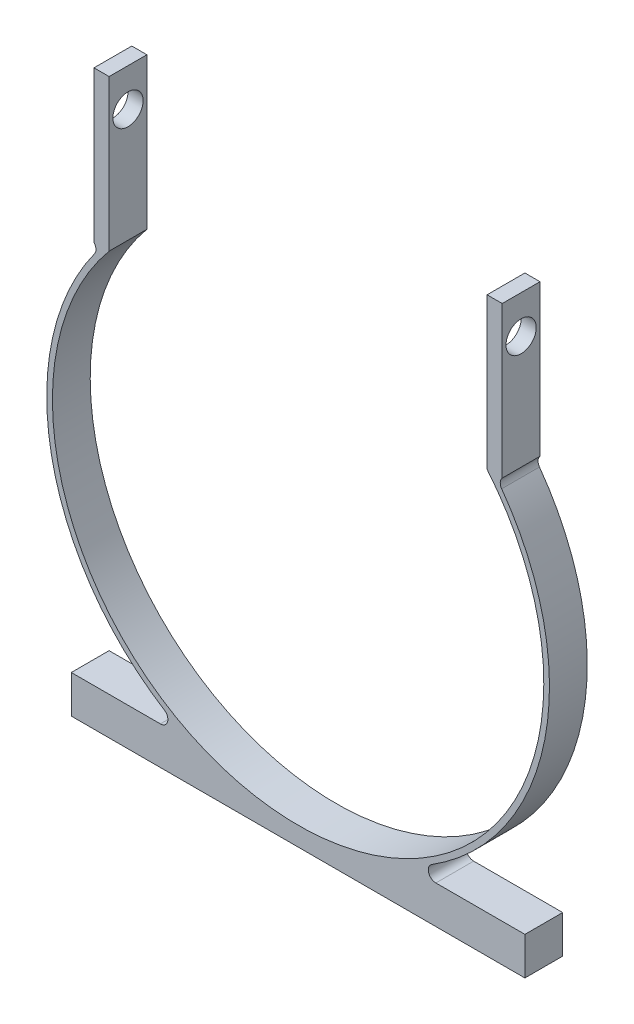
ISO-10303-21;
HEADER;
FILE_DESCRIPTION(('STEP AP214'),'2;1');
FILE_NAME('part.step','',(''),(''),'','','');
FILE_SCHEMA(('AUTOMOTIVE_DESIGN { 1 0 10303 214 1 1 1 1 }'));
ENDSEC;
DATA;
#1=APPLICATION_CONTEXT('core data for automotive mechanical design processes');
#2=APPLICATION_PROTOCOL_DEFINITION('international standard','automotive_design',2000,#1);
#3=PRODUCT_CONTEXT('',#1,'mechanical');
#4=PRODUCT('Part','Part','',(#3));
#5=PRODUCT_RELATED_PRODUCT_CATEGORY('part','',(#4));
#6=PRODUCT_DEFINITION_FORMATION('','',#4);
#7=PRODUCT_DEFINITION_CONTEXT('part definition',#1,'design');
#8=PRODUCT_DEFINITION('design','',#6,#7);
#9=PRODUCT_DEFINITION_SHAPE('','',#8);
#10=(LENGTH_UNIT() NAMED_UNIT(*) SI_UNIT(.MILLI.,.METRE.));
#11=(NAMED_UNIT(*) PLANE_ANGLE_UNIT() SI_UNIT($,.RADIAN.));
#12=(NAMED_UNIT(*) SI_UNIT($,.STERADIAN.) SOLID_ANGLE_UNIT());
#13=UNCERTAINTY_MEASURE_WITH_UNIT(LENGTH_MEASURE(1.E-05),#10,'distance_accuracy_value','');
#14=(GEOMETRIC_REPRESENTATION_CONTEXT(3) GLOBAL_UNCERTAINTY_ASSIGNED_CONTEXT((#13)) GLOBAL_UNIT_ASSIGNED_CONTEXT((#10,
#11,#12)) REPRESENTATION_CONTEXT('',''));
#15=CARTESIAN_POINT('',(0.,0.,0.));
#16=DIRECTION('',(0.,0.,1.));
#17=DIRECTION('',(1.,0.,0.));
#18=AXIS2_PLACEMENT_3D('',#15,#16,#17);
#19=CARTESIAN_POINT('',(0.,0.,6.35));
#20=DIRECTION('',(0.,0.,-1.));
#21=DIRECTION('',(-1.,0.,0.));
#22=AXIS2_PLACEMENT_3D('',#19,#20,#21);
#23=CYLINDRICAL_SURFACE('',#22,42.2275);
#24=CARTESIAN_POINT('',(0.,0.,0.));
#25=DIRECTION('',(0.,0.,1.));
#26=DIRECTION('',(1.,0.,0.));
#27=AXIS2_PLACEMENT_3D('',#24,#25,#26);
#28=CIRCLE('',#27,42.2275);
#29=CARTESIAN_POINT('',(22.4669806566935,-35.7546715328467,0.));
#30=VERTEX_POINT('',#29);
#31=CARTESIAN_POINT('',(34.198566610267,24.7713503477935,0.));
#32=VERTEX_POINT('',#31);
#33=EDGE_CURVE('E259',#30,#32,#28,.T.);
#34=ORIENTED_EDGE('',*,*,#33,.T.);
#35=DIRECTION('',(0.,0.,-1.));
#36=VECTOR('',#35,1.);
#37=CARTESIAN_POINT('',(34.198566610267,24.7713503477935,6.35));
#38=LINE('',#37,#36);
#39=CARTESIAN_POINT('',(34.198566610267,24.7713503477935,6.35));
#40=VERTEX_POINT('',#39);
#41=EDGE_CURVE('E55',#32,#40,#38,.F.);
#42=ORIENTED_EDGE('',*,*,#41,.T.);
#43=CARTESIAN_POINT('',(0.,0.,6.35));
#44=DIRECTION('',(0.,0.,1.));
#45=DIRECTION('',(1.,0.,0.));
#46=AXIS2_PLACEMENT_3D('',#43,#44,#45);
#47=CIRCLE('',#46,42.2275);
#48=CARTESIAN_POINT('',(22.4669806566935,-35.7546715328467,6.35));
#49=VERTEX_POINT('',#48);
#50=EDGE_CURVE('E244',#49,#40,#47,.T.);
#51=ORIENTED_EDGE('',*,*,#50,.F.);
#52=DIRECTION('',(0.,0.,-1.));
#53=VECTOR('',#52,1.);
#54=CARTESIAN_POINT('',(22.4669806566935,-35.7546715328467,6.35));
#55=LINE('',#54,#53);
#56=EDGE_CURVE('E276',#49,#30,#55,.T.);
#57=ORIENTED_EDGE('',*,*,#56,.T.);
#58=EDGE_LOOP('',(#34,#42,#51,#57));
#59=FACE_BOUND('',#58,.T.);
#60=ADVANCED_FACE('F33',(#59),#23,.T.);
#61=CARTESIAN_POINT('',(0.,0.,6.35));
#62=DIRECTION('',(0.,0.,1.));
#63=DIRECTION('',(1.,0.,0.));
#64=AXIS2_PLACEMENT_3D('',#61,#62,#63);
#65=PLANE('',#64);
#66=DIRECTION('',(0.,-1.,0.));
#67=VECTOR('',#66,1.);
#68=CARTESIAN_POINT('',(31.75,61.2775,6.35));
#69=LINE('',#68,#67);
#70=CARTESIAN_POINT('',(31.75,51.7735307647649,6.35));
#71=VERTEX_POINT('',#70);
#72=CARTESIAN_POINT('',(31.75,26.3735307647649,6.35));
#73=VERTEX_POINT('',#72);
#74=EDGE_CURVE('E192',#71,#73,#69,.T.);
#75=ORIENTED_EDGE('',*,*,#74,.T.);
#76=CARTESIAN_POINT('',(0.,0.,6.35));
#77=DIRECTION('',(0.,0.,1.));
#78=DIRECTION('',(1.,0.,0.));
#79=AXIS2_PLACEMENT_3D('',#76,#77,#78);
#80=CIRCLE('',#79,41.275);
#81=CARTESIAN_POINT('',(-31.75,26.3735307647649,6.35));
#82=VERTEX_POINT('',#81);
#83=EDGE_CURVE('E226',#82,#73,#80,.T.);
#84=ORIENTED_EDGE('',*,*,#83,.F.);
#85=DIRECTION('',(0.,-1.,0.));
#86=VECTOR('',#85,1.);
#87=CARTESIAN_POINT('',(-31.75,61.2775,6.35));
#88=LINE('',#87,#86);
#89=CARTESIAN_POINT('',(-31.75,51.7735307647649,6.35));
#90=VERTEX_POINT('',#89);
#91=EDGE_CURVE('E219',#90,#82,#88,.T.);
#92=ORIENTED_EDGE('',*,*,#91,.F.);
#93=DIRECTION('',(1.,0.,0.));
#94=VECTOR('',#93,1.);
#95=CARTESIAN_POINT('',(-34.29,51.7735307647649,6.35));
#96=LINE('',#95,#94);
#97=CARTESIAN_POINT('',(-34.29,51.7735307647649,6.35));
#98=VERTEX_POINT('',#97);
#99=EDGE_CURVE('E216',#98,#90,#96,.T.);
#100=ORIENTED_EDGE('',*,*,#99,.F.);
#101=DIRECTION('',(0.,-1.,0.));
#102=VECTOR('',#101,1.);
#103=CARTESIAN_POINT('',(-34.29,26.3735307647649,6.35));
#104=LINE('',#103,#102);
#105=CARTESIAN_POINT('',(-34.29,26.3735307647649,6.35));
#106=VERTEX_POINT('',#105);
#107=EDGE_CURVE('E201',#98,#106,#104,.T.);
#108=ORIENTED_EDGE('',*,*,#107,.T.);
#109=CARTESIAN_POINT('',(-35.2270949293728,25.5163533657722,6.35));
#110=DIRECTION('',(0.,0.,1.));
#111=DIRECTION('',(1.,0.,0.));
#112=AXIS2_PLACEMENT_3D('',#109,#110,#111);
#113=CIRCLE('',#112,1.27);
#114=CARTESIAN_POINT('',(-34.198566610267,24.7713503477935,6.35));
#115=VERTEX_POINT('',#114);
#116=EDGE_CURVE('E298',#106,#115,#113,.F.);
#117=ORIENTED_EDGE('',*,*,#116,.T.);
#118=CARTESIAN_POINT('',(-22.4669806566935,-35.7546715328467,6.35));
#119=VERTEX_POINT('',#118);
#120=EDGE_CURVE('E243',#115,#119,#47,.T.);
#121=ORIENTED_EDGE('',*,*,#120,.T.);
#122=CARTESIAN_POINT('',(-23.1426793230602,-36.83,6.35));
#123=DIRECTION('',(0.,0.,1.));
#124=DIRECTION('',(1.,0.,0.));
#125=AXIS2_PLACEMENT_3D('',#122,#123,#124);
#126=CIRCLE('',#125,1.27);
#127=CARTESIAN_POINT('',(-23.1426793230602,-38.1,6.35));
#128=VERTEX_POINT('',#127);
#129=EDGE_CURVE('E287',#119,#128,#126,.F.);
#130=ORIENTED_EDGE('',*,*,#129,.T.);
#131=DIRECTION('',(-1.,0.,0.));
#132=VECTOR('',#131,1.);
#133=CARTESIAN_POINT('',(-18.2085627178533,-38.1,6.35));
#134=LINE('',#133,#132);
#135=CARTESIAN_POINT('',(-38.1,-38.1,6.35));
#136=VERTEX_POINT('',#135);
#137=EDGE_CURVE('E246',#128,#136,#134,.T.);
#138=ORIENTED_EDGE('',*,*,#137,.T.);
#139=DIRECTION('',(0.,-1.,0.));
#140=VECTOR('',#139,1.);
#141=CARTESIAN_POINT('',(-38.1,-38.1,6.35));
#142=LINE('',#141,#140);
#143=CARTESIAN_POINT('',(-38.1,-44.45,6.35));
#144=VERTEX_POINT('',#143);
#145=EDGE_CURVE('E232',#136,#144,#142,.T.);
#146=ORIENTED_EDGE('',*,*,#145,.T.);
#147=DIRECTION('',(1.,0.,0.));
#148=VECTOR('',#147,1.);
#149=CARTESIAN_POINT('',(38.1,-44.45,6.35));
#150=LINE('',#149,#148);
#151=CARTESIAN_POINT('',(38.1,-44.45,6.35));
#152=VERTEX_POINT('',#151);
#153=EDGE_CURVE('E235',#144,#152,#150,.T.);
#154=ORIENTED_EDGE('',*,*,#153,.T.);
#155=DIRECTION('',(0.,1.,0.));
#156=VECTOR('',#155,1.);
#157=CARTESIAN_POINT('',(38.1,-38.1,6.35));
#158=LINE('',#157,#156);
#159=CARTESIAN_POINT('',(38.1,-38.1,6.35));
#160=VERTEX_POINT('',#159);
#161=EDGE_CURVE('E238',#152,#160,#158,.T.);
#162=ORIENTED_EDGE('',*,*,#161,.T.);
#163=DIRECTION('',(-1.,0.,0.));
#164=VECTOR('',#163,1.);
#165=CARTESIAN_POINT('',(38.1,-38.1,6.35));
#166=LINE('',#165,#164);
#167=CARTESIAN_POINT('',(23.1426793230602,-38.1,6.35));
#168=VERTEX_POINT('',#167);
#169=EDGE_CURVE('E240',#160,#168,#166,.T.);
#170=ORIENTED_EDGE('',*,*,#169,.T.);
#171=CARTESIAN_POINT('',(23.1426793230602,-36.83,6.35));
#172=DIRECTION('',(0.,0.,1.));
#173=DIRECTION('',(1.,0.,0.));
#174=AXIS2_PLACEMENT_3D('',#171,#172,#173);
#175=CIRCLE('',#174,1.27);
#176=EDGE_CURVE('E291',#168,#49,#175,.F.);
#177=ORIENTED_EDGE('',*,*,#176,.T.);
#178=ORIENTED_EDGE('',*,*,#50,.T.);
#179=CARTESIAN_POINT('',(35.2270949293728,25.5163533657723,6.35));
#180=DIRECTION('',(0.,0.,1.));
#181=DIRECTION('',(1.,0.,0.));
#182=AXIS2_PLACEMENT_3D('',#179,#180,#181);
#183=CIRCLE('',#182,1.27);
#184=CARTESIAN_POINT('',(34.29,26.3735307647649,6.35));
#185=VERTEX_POINT('',#184);
#186=EDGE_CURVE('E11',#40,#185,#183,.F.);
#187=ORIENTED_EDGE('',*,*,#186,.T.);
#188=DIRECTION('',(0.,-1.,0.));
#189=VECTOR('',#188,1.);
#190=CARTESIAN_POINT('',(34.29,26.3735307647649,6.35));
#191=LINE('',#190,#189);
#192=CARTESIAN_POINT('',(34.29,51.7735307647649,6.35));
#193=VERTEX_POINT('',#192);
#194=EDGE_CURVE('E164',#193,#185,#191,.T.);
#195=ORIENTED_EDGE('',*,*,#194,.F.);
#196=DIRECTION('',(-1.,0.,0.));
#197=VECTOR('',#196,1.);
#198=CARTESIAN_POINT('',(34.29,51.7735307647649,6.35));
#199=LINE('',#198,#197);
#200=EDGE_CURVE('E173',#193,#71,#199,.T.);
#201=ORIENTED_EDGE('',*,*,#200,.T.);
#202=EDGE_LOOP('',(#75,#84,#92,#100,#108,#117,#121,#130,#138,#146,#154,#162,#170,#177,#178,#187,
#195,#201));
#203=FACE_BOUND('',#202,.T.);
#204=ADVANCED_FACE('F182',(#203),#65,.T.);
#205=CARTESIAN_POINT('',(0.,0.,0.));
#206=DIRECTION('',(0.,0.,1.));
#207=DIRECTION('',(1.,0.,0.));
#208=AXIS2_PLACEMENT_3D('',#205,#206,#207);
#209=PLANE('',#208);
#210=DIRECTION('',(0.,-1.,0.));
#211=VECTOR('',#210,1.);
#212=CARTESIAN_POINT('',(31.75,61.2775,0.));
#213=LINE('',#212,#211);
#214=CARTESIAN_POINT('',(31.75,51.7735307647649,0.));
#215=VERTEX_POINT('',#214);
#216=CARTESIAN_POINT('',(31.75,26.3735307647649,0.));
#217=VERTEX_POINT('',#216);
#218=EDGE_CURVE('E194',#215,#217,#213,.T.);
#219=ORIENTED_EDGE('',*,*,#218,.F.);
#220=DIRECTION('',(-1.,0.,0.));
#221=VECTOR('',#220,1.);
#222=CARTESIAN_POINT('',(34.29,51.7735307647649,0.));
#223=LINE('',#222,#221);
#224=CARTESIAN_POINT('',(34.29,51.7735307647649,0.));
#225=VERTEX_POINT('',#224);
#226=EDGE_CURVE('E179',#225,#215,#223,.T.);
#227=ORIENTED_EDGE('',*,*,#226,.F.);
#228=DIRECTION('',(0.,1.,0.));
#229=VECTOR('',#228,1.);
#230=CARTESIAN_POINT('',(34.29,26.3735307647649,0.));
#231=LINE('',#230,#229);
#232=CARTESIAN_POINT('',(34.29,26.3735307647649,0.));
#233=VERTEX_POINT('',#232);
#234=EDGE_CURVE('E166',#233,#225,#231,.T.);
#235=ORIENTED_EDGE('',*,*,#234,.F.);
#236=CARTESIAN_POINT('',(35.2270949293728,25.5163533657723,0.));
#237=DIRECTION('',(0.,0.,1.));
#238=DIRECTION('',(1.,0.,0.));
#239=AXIS2_PLACEMENT_3D('',#236,#237,#238);
#240=CIRCLE('',#239,1.27);
#241=EDGE_CURVE('E42',#233,#32,#240,.T.);
#242=ORIENTED_EDGE('',*,*,#241,.T.);
#243=ORIENTED_EDGE('',*,*,#33,.F.);
#244=CARTESIAN_POINT('',(23.1426793230602,-36.83,0.));
#245=DIRECTION('',(0.,0.,1.));
#246=DIRECTION('',(1.,0.,0.));
#247=AXIS2_PLACEMENT_3D('',#244,#245,#246);
#248=CIRCLE('',#247,1.27);
#249=CARTESIAN_POINT('',(23.1426793230602,-38.1,0.));
#250=VERTEX_POINT('',#249);
#251=EDGE_CURVE('E289',#30,#250,#248,.T.);
#252=ORIENTED_EDGE('',*,*,#251,.T.);
#253=DIRECTION('',(-1.,0.,0.));
#254=VECTOR('',#253,1.);
#255=CARTESIAN_POINT('',(38.1,-38.1,0.));
#256=LINE('',#255,#254);
#257=CARTESIAN_POINT('',(38.1,-38.1,0.));
#258=VERTEX_POINT('',#257);
#259=EDGE_CURVE('E255',#258,#250,#256,.T.);
#260=ORIENTED_EDGE('',*,*,#259,.F.);
#261=DIRECTION('',(0.,1.,0.));
#262=VECTOR('',#261,1.);
#263=CARTESIAN_POINT('',(38.1,-38.1,0.));
#264=LINE('',#263,#262);
#265=CARTESIAN_POINT('',(38.1,-44.45,0.));
#266=VERTEX_POINT('',#265);
#267=EDGE_CURVE('E253',#266,#258,#264,.T.);
#268=ORIENTED_EDGE('',*,*,#267,.F.);
#269=DIRECTION('',(1.,0.,0.));
#270=VECTOR('',#269,1.);
#271=CARTESIAN_POINT('',(38.1,-44.45,0.));
#272=LINE('',#271,#270);
#273=CARTESIAN_POINT('',(-38.1,-44.45,0.));
#274=VERTEX_POINT('',#273);
#275=EDGE_CURVE('E251',#274,#266,#272,.T.);
#276=ORIENTED_EDGE('',*,*,#275,.F.);
#277=DIRECTION('',(0.,-1.,0.));
#278=VECTOR('',#277,1.);
#279=CARTESIAN_POINT('',(-38.1,-38.1,0.));
#280=LINE('',#279,#278);
#281=CARTESIAN_POINT('',(-38.1,-38.1,0.));
#282=VERTEX_POINT('',#281);
#283=EDGE_CURVE('E229',#282,#274,#280,.T.);
#284=ORIENTED_EDGE('',*,*,#283,.F.);
#285=DIRECTION('',(-1.,0.,0.));
#286=VECTOR('',#285,1.);
#287=CARTESIAN_POINT('',(-18.2085627178533,-38.1,0.));
#288=LINE('',#287,#286);
#289=CARTESIAN_POINT('',(-23.1426793230602,-38.1,0.));
#290=VERTEX_POINT('',#289);
#291=EDGE_CURVE('E236',#290,#282,#288,.T.);
#292=ORIENTED_EDGE('',*,*,#291,.F.);
#293=CARTESIAN_POINT('',(-23.1426793230602,-36.83,0.));
#294=DIRECTION('',(0.,0.,1.));
#295=DIRECTION('',(1.,0.,0.));
#296=AXIS2_PLACEMENT_3D('',#293,#294,#295);
#297=CIRCLE('',#296,1.27);
#298=CARTESIAN_POINT('',(-22.4669806566935,-35.7546715328467,0.));
#299=VERTEX_POINT('',#298);
#300=EDGE_CURVE('E284',#290,#299,#297,.T.);
#301=ORIENTED_EDGE('',*,*,#300,.T.);
#302=CARTESIAN_POINT('',(-34.198566610267,24.7713503477935,0.));
#303=VERTEX_POINT('',#302);
#304=EDGE_CURVE('E258',#303,#299,#28,.T.);
#305=ORIENTED_EDGE('',*,*,#304,.F.);
#306=CARTESIAN_POINT('',(-35.2270949293728,25.5163533657722,0.));
#307=DIRECTION('',(0.,0.,1.));
#308=DIRECTION('',(1.,0.,0.));
#309=AXIS2_PLACEMENT_3D('',#306,#307,#308);
#310=CIRCLE('',#309,1.27);
#311=CARTESIAN_POINT('',(-34.29,26.3735307647649,0.));
#312=VERTEX_POINT('',#311);
#313=EDGE_CURVE('E296',#303,#312,#310,.T.);
#314=ORIENTED_EDGE('',*,*,#313,.T.);
#315=DIRECTION('',(0.,1.,0.));
#316=VECTOR('',#315,1.);
#317=CARTESIAN_POINT('',(-34.29,26.3735307647649,0.));
#318=LINE('',#317,#316);
#319=CARTESIAN_POINT('',(-34.29,51.7735307647649,0.));
#320=VERTEX_POINT('',#319);
#321=EDGE_CURVE('E207',#312,#320,#318,.T.);
#322=ORIENTED_EDGE('',*,*,#321,.T.);
#323=DIRECTION('',(1.,0.,0.));
#324=VECTOR('',#323,1.);
#325=CARTESIAN_POINT('',(-34.29,51.7735307647649,0.));
#326=LINE('',#325,#324);
#327=CARTESIAN_POINT('',(-31.75,51.7735307647649,0.));
#328=VERTEX_POINT('',#327);
#329=EDGE_CURVE('E213',#320,#328,#326,.T.);
#330=ORIENTED_EDGE('',*,*,#329,.T.);
#331=DIRECTION('',(0.,-1.,0.));
#332=VECTOR('',#331,1.);
#333=CARTESIAN_POINT('',(-31.75,61.2775,0.));
#334=LINE('',#333,#332);
#335=CARTESIAN_POINT('',(-31.75,26.3735307647649,0.));
#336=VERTEX_POINT('',#335);
#337=EDGE_CURVE('E222',#328,#336,#334,.T.);
#338=ORIENTED_EDGE('',*,*,#337,.T.);
#339=CARTESIAN_POINT('',(0.,0.,0.));
#340=DIRECTION('',(0.,0.,1.));
#341=DIRECTION('',(1.,0.,0.));
#342=AXIS2_PLACEMENT_3D('',#339,#340,#341);
#343=CIRCLE('',#342,41.275);
#344=EDGE_CURVE('E224',#336,#217,#343,.T.);
#345=ORIENTED_EDGE('',*,*,#344,.T.);
#346=EDGE_LOOP('',(#219,#227,#235,#242,#243,#252,#260,#268,#276,#284,#292,#301,#305,#314,#322,
#330,#338,#345));
#347=FACE_BOUND('',#346,.T.);
#348=ADVANCED_FACE('F309',(#347),#209,.F.);
#349=CARTESIAN_POINT('',(0.,0.,6.35));
#350=DIRECTION('',(0.,0.,-1.));
#351=DIRECTION('',(-1.,0.,0.));
#352=AXIS2_PLACEMENT_3D('',#349,#350,#351);
#353=CYLINDRICAL_SURFACE('',#352,41.275);
#354=ORIENTED_EDGE('',*,*,#344,.F.);
#355=DIRECTION('',(0.,0.,-1.));
#356=VECTOR('',#355,1.);
#357=CARTESIAN_POINT('',(-31.75,26.3735307647649,6.35));
#358=LINE('',#357,#356);
#359=EDGE_CURVE('E196',#336,#82,#358,.F.);
#360=ORIENTED_EDGE('',*,*,#359,.T.);
#361=ORIENTED_EDGE('',*,*,#83,.T.);
#362=DIRECTION('',(0.,0.,-1.));
#363=VECTOR('',#362,1.);
#364=CARTESIAN_POINT('',(31.75,26.3735307647649,6.35));
#365=LINE('',#364,#363);
#366=EDGE_CURVE('E300',#73,#217,#365,.T.);
#367=ORIENTED_EDGE('',*,*,#366,.T.);
#368=EDGE_LOOP('',(#354,#360,#361,#367));
#369=FACE_BOUND('',#368,.T.);
#370=ADVANCED_FACE('F306',(#369),#353,.F.);
#371=CARTESIAN_POINT('',(-38.1,-38.1,6.35));
#372=DIRECTION('',(1.,0.,0.));
#373=DIRECTION('',(0.,0.,-1.));
#374=AXIS2_PLACEMENT_3D('',#371,#372,#373);
#375=PLANE('',#374);
#376=ORIENTED_EDGE('',*,*,#283,.T.);
#377=DIRECTION('',(0.,0.,-1.));
#378=VECTOR('',#377,1.);
#379=CARTESIAN_POINT('',(-38.1,-44.45,6.35));
#380=LINE('',#379,#378);
#381=EDGE_CURVE('E270',#144,#274,#380,.T.);
#382=ORIENTED_EDGE('',*,*,#381,.F.);
#383=ORIENTED_EDGE('',*,*,#145,.F.);
#384=DIRECTION('',(0.,0.,-1.));
#385=VECTOR('',#384,1.);
#386=CARTESIAN_POINT('',(-38.1,-38.1,6.35));
#387=LINE('',#386,#385);
#388=EDGE_CURVE('E248',#136,#282,#387,.T.);
#389=ORIENTED_EDGE('',*,*,#388,.T.);
#390=EDGE_LOOP('',(#376,#382,#383,#389));
#391=FACE_BOUND('',#390,.T.);
#392=ADVANCED_FACE('F373',(#391),#375,.F.);
#393=CARTESIAN_POINT('',(38.1,-44.45,6.35));
#394=DIRECTION('',(0.,1.,0.));
#395=DIRECTION('',(-1.,0.,0.));
#396=AXIS2_PLACEMENT_3D('',#393,#394,#395);
#397=PLANE('',#396);
#398=ORIENTED_EDGE('',*,*,#275,.T.);
#399=DIRECTION('',(0.,0.,-1.));
#400=VECTOR('',#399,1.);
#401=CARTESIAN_POINT('',(38.1,-44.45,6.35));
#402=LINE('',#401,#400);
#403=EDGE_CURVE('E267',#152,#266,#402,.T.);
#404=ORIENTED_EDGE('',*,*,#403,.F.);
#405=ORIENTED_EDGE('',*,*,#153,.F.);
#406=ORIENTED_EDGE('',*,*,#381,.T.);
#407=EDGE_LOOP('',(#398,#404,#405,#406));
#408=FACE_BOUND('',#407,.T.);
#409=ADVANCED_FACE('F391',(#408),#397,.F.);
#410=CARTESIAN_POINT('',(38.1,-38.1,6.35));
#411=DIRECTION('',(-1.,0.,0.));
#412=DIRECTION('',(0.,-1.,0.));
#413=AXIS2_PLACEMENT_3D('',#410,#411,#412);
#414=PLANE('',#413);
#415=ORIENTED_EDGE('',*,*,#267,.T.);
#416=DIRECTION('',(0.,0.,-1.));
#417=VECTOR('',#416,1.);
#418=CARTESIAN_POINT('',(38.1,-38.1,6.35));
#419=LINE('',#418,#417);
#420=EDGE_CURVE('E264',#160,#258,#419,.T.);
#421=ORIENTED_EDGE('',*,*,#420,.F.);
#422=ORIENTED_EDGE('',*,*,#161,.F.);
#423=ORIENTED_EDGE('',*,*,#403,.T.);
#424=EDGE_LOOP('',(#415,#421,#422,#423));
#425=FACE_BOUND('',#424,.T.);
#426=ADVANCED_FACE('F347',(#425),#414,.F.);
#427=CARTESIAN_POINT('',(38.1,-38.1,6.35));
#428=DIRECTION('',(0.,-1.,0.));
#429=DIRECTION('',(1.,0.,0.));
#430=AXIS2_PLACEMENT_3D('',#427,#428,#429);
#431=PLANE('',#430);
#432=ORIENTED_EDGE('',*,*,#259,.T.);
#433=DIRECTION('',(0.,0.,1.));
#434=VECTOR('',#433,1.);
#435=CARTESIAN_POINT('',(23.1426793230602,-38.1,6.35));
#436=LINE('',#435,#434);
#437=EDGE_CURVE('E282',#250,#168,#436,.T.);
#438=ORIENTED_EDGE('',*,*,#437,.T.);
#439=ORIENTED_EDGE('',*,*,#169,.F.);
#440=ORIENTED_EDGE('',*,*,#420,.T.);
#441=EDGE_LOOP('',(#432,#438,#439,#440));
#442=FACE_BOUND('',#441,.T.);
#443=ADVANCED_FACE('F339',(#442),#431,.F.);
#444=ORIENTED_EDGE('',*,*,#120,.F.);
#445=DIRECTION('',(0.,0.,-1.));
#446=VECTOR('',#445,1.);
#447=CARTESIAN_POINT('',(-34.198566610267,24.7713503477935,6.35));
#448=LINE('',#447,#446);
#449=EDGE_CURVE('E293',#115,#303,#448,.T.);
#450=ORIENTED_EDGE('',*,*,#449,.T.);
#451=ORIENTED_EDGE('',*,*,#304,.T.);
#452=DIRECTION('',(0.,0.,-1.));
#453=VECTOR('',#452,1.);
#454=CARTESIAN_POINT('',(-22.4669806566935,-35.7546715328467,6.35));
#455=LINE('',#454,#453);
#456=EDGE_CURVE('E279',#299,#119,#455,.F.);
#457=ORIENTED_EDGE('',*,*,#456,.T.);
#458=EDGE_LOOP('',(#444,#450,#451,#457));
#459=FACE_BOUND('',#458,.T.);
#460=ADVANCED_FACE('F330',(#459),#23,.T.);
#461=CARTESIAN_POINT('',(-18.2085627178533,-38.1,6.35));
#462=DIRECTION('',(0.,-1.,0.));
#463=DIRECTION('',(1.,0.,0.));
#464=AXIS2_PLACEMENT_3D('',#461,#462,#463);
#465=PLANE('',#464);
#466=ORIENTED_EDGE('',*,*,#137,.F.);
#467=DIRECTION('',(0.,0.,1.));
#468=VECTOR('',#467,1.);
#469=CARTESIAN_POINT('',(-23.1426793230602,-38.1,0.));
#470=LINE('',#469,#468);
#471=EDGE_CURVE('E273',#128,#290,#470,.F.);
#472=ORIENTED_EDGE('',*,*,#471,.T.);
#473=ORIENTED_EDGE('',*,*,#291,.T.);
#474=ORIENTED_EDGE('',*,*,#388,.F.);
#475=EDGE_LOOP('',(#466,#472,#473,#474));
#476=FACE_BOUND('',#475,.T.);
#477=ADVANCED_FACE('F338',(#476),#465,.F.);
#478=CARTESIAN_POINT('',(-23.1426793230602,-36.83,6.35));
#479=DIRECTION('',(0.,0.,-1.));
#480=DIRECTION('',(-1.,0.,0.));
#481=AXIS2_PLACEMENT_3D('',#478,#479,#480);
#482=CYLINDRICAL_SURFACE('',#481,1.27);
#483=ORIENTED_EDGE('',*,*,#129,.F.);
#484=ORIENTED_EDGE('',*,*,#456,.F.);
#485=ORIENTED_EDGE('',*,*,#300,.F.);
#486=ORIENTED_EDGE('',*,*,#471,.F.);
#487=EDGE_LOOP('',(#483,#484,#485,#486));
#488=FACE_BOUND('',#487,.T.);
#489=ADVANCED_FACE('F345',(#488),#482,.F.);
#490=CARTESIAN_POINT('',(23.1426793230602,-36.83,6.35));
#491=DIRECTION('',(0.,0.,-1.));
#492=DIRECTION('',(-1.,0.,0.));
#493=AXIS2_PLACEMENT_3D('',#490,#491,#492);
#494=CYLINDRICAL_SURFACE('',#493,1.27);
#495=ORIENTED_EDGE('',*,*,#176,.F.);
#496=ORIENTED_EDGE('',*,*,#437,.F.);
#497=ORIENTED_EDGE('',*,*,#251,.F.);
#498=ORIENTED_EDGE('',*,*,#56,.F.);
#499=EDGE_LOOP('',(#495,#496,#497,#498));
#500=FACE_BOUND('',#499,.T.);
#501=ADVANCED_FACE('F368',(#500),#494,.F.);
#502=CARTESIAN_POINT('',(-31.75,61.2775,0.));
#503=DIRECTION('',(-1.,0.,0.));
#504=DIRECTION('',(0.,-1.,0.));
#505=AXIS2_PLACEMENT_3D('',#502,#503,#504);
#506=PLANE('',#505);
#507=CARTESIAN_POINT('',(-31.75,45.4235307647649,3.175));
#508=DIRECTION('',(-1.,0.,0.));
#509=DIRECTION('',(0.,-1.,0.));
#510=AXIS2_PLACEMENT_3D('',#507,#508,#509);
#511=CIRCLE('',#510,2.54);
#512=CARTESIAN_POINT('',(-31.75,42.8835307647649,3.175));
#513=VERTEX_POINT('',#512);
#514=EDGE_CURVE('E185',#513,#513,#511,.T.);
#515=ORIENTED_EDGE('',*,*,#514,.T.);
#516=EDGE_LOOP('',(#515));
#517=FACE_BOUND('',#516,.T.);
#518=ORIENTED_EDGE('',*,*,#91,.T.);
#519=ORIENTED_EDGE('',*,*,#359,.F.);
#520=ORIENTED_EDGE('',*,*,#337,.F.);
#521=DIRECTION('',(0.,0.,1.));
#522=VECTOR('',#521,1.);
#523=CARTESIAN_POINT('',(-31.75,51.7735307647649,6.35));
#524=LINE('',#523,#522);
#525=EDGE_CURVE('E200',#328,#90,#524,.T.);
#526=ORIENTED_EDGE('',*,*,#525,.T.);
#527=EDGE_LOOP('',(#518,#519,#520,#526));
#528=FACE_BOUND('',#527,.T.);
#529=ADVANCED_FACE('F313',(#517,#528),#506,.F.);
#530=CARTESIAN_POINT('',(-34.29,51.7735307647649,6.35));
#531=DIRECTION('',(0.,1.,0.));
#532=DIRECTION('',(-1.,0.,0.));
#533=AXIS2_PLACEMENT_3D('',#530,#531,#532);
#534=PLANE('',#533);
#535=ORIENTED_EDGE('',*,*,#525,.F.);
#536=ORIENTED_EDGE('',*,*,#329,.F.);
#537=DIRECTION('',(0.,0.,1.));
#538=VECTOR('',#537,1.);
#539=CARTESIAN_POINT('',(-34.29,51.7735307647649,6.35));
#540=LINE('',#539,#538);
#541=EDGE_CURVE('E210',#320,#98,#540,.T.);
#542=ORIENTED_EDGE('',*,*,#541,.T.);
#543=ORIENTED_EDGE('',*,*,#99,.T.);
#544=EDGE_LOOP('',(#535,#536,#542,#543));
#545=FACE_BOUND('',#544,.T.);
#546=ADVANCED_FACE('F360',(#545),#534,.T.);
#547=CARTESIAN_POINT('',(-34.29,51.7735307647649,6.35));
#548=DIRECTION('',(-1.,0.,0.));
#549=DIRECTION('',(0.,-1.,0.));
#550=AXIS2_PLACEMENT_3D('',#547,#548,#549);
#551=PLANE('',#550);
#552=CARTESIAN_POINT('',(-34.29,45.4235307647649,3.175));
#553=DIRECTION('',(-1.,0.,0.));
#554=DIRECTION('',(0.,-1.,0.));
#555=AXIS2_PLACEMENT_3D('',#552,#553,#554);
#556=CIRCLE('',#555,2.54);
#557=CARTESIAN_POINT('',(-34.29,42.8835307647649,3.175));
#558=VERTEX_POINT('',#557);
#559=EDGE_CURVE('E531',#558,#558,#556,.T.);
#560=ORIENTED_EDGE('',*,*,#559,.F.);
#561=EDGE_LOOP('',(#560));
#562=FACE_BOUND('',#561,.T.);
#563=ORIENTED_EDGE('',*,*,#107,.F.);
#564=ORIENTED_EDGE('',*,*,#541,.F.);
#565=ORIENTED_EDGE('',*,*,#321,.F.);
#566=DIRECTION('',(0.,0.,-1.));
#567=VECTOR('',#566,1.);
#568=CARTESIAN_POINT('',(-34.29,26.3735307647649,6.35));
#569=LINE('',#568,#567);
#570=EDGE_CURVE('E204',#106,#312,#569,.T.);
#571=ORIENTED_EDGE('',*,*,#570,.F.);
#572=EDGE_LOOP('',(#563,#564,#565,#571));
#573=FACE_BOUND('',#572,.T.);
#574=ADVANCED_FACE('F324',(#562,#573),#551,.T.);
#575=CARTESIAN_POINT('',(-35.2270949293728,25.5163533657722,6.35));
#576=DIRECTION('',(0.,0.,1.));
#577=DIRECTION('',(1.,0.,0.));
#578=AXIS2_PLACEMENT_3D('',#575,#576,#577);
#579=CYLINDRICAL_SURFACE('',#578,1.27);
#580=ORIENTED_EDGE('',*,*,#116,.F.);
#581=ORIENTED_EDGE('',*,*,#570,.T.);
#582=ORIENTED_EDGE('',*,*,#313,.F.);
#583=ORIENTED_EDGE('',*,*,#449,.F.);
#584=EDGE_LOOP('',(#580,#581,#582,#583));
#585=FACE_BOUND('',#584,.T.);
#586=ADVANCED_FACE('F316',(#585),#579,.F.);
#587=CARTESIAN_POINT('',(31.75,61.2775,0.));
#588=DIRECTION('',(-1.,0.,0.));
#589=DIRECTION('',(0.,-1.,0.));
#590=AXIS2_PLACEMENT_3D('',#587,#588,#589);
#591=PLANE('',#590);
#592=CARTESIAN_POINT('',(31.75,45.4235307647649,3.175));
#593=DIRECTION('',(-1.,0.,0.));
#594=DIRECTION('',(0.,-1.,0.));
#595=AXIS2_PLACEMENT_3D('',#592,#593,#594);
#596=CIRCLE('',#595,2.54);
#597=CARTESIAN_POINT('',(31.75,42.8835307647649,3.175));
#598=VERTEX_POINT('',#597);
#599=EDGE_CURVE('E534',#598,#598,#596,.T.);
#600=ORIENTED_EDGE('',*,*,#599,.F.);
#601=EDGE_LOOP('',(#600));
#602=FACE_BOUND('',#601,.T.);
#603=ORIENTED_EDGE('',*,*,#74,.F.);
#604=DIRECTION('',(0.,0.,1.));
#605=VECTOR('',#604,1.);
#606=CARTESIAN_POINT('',(31.75,51.7735307647649,6.35));
#607=LINE('',#606,#605);
#608=EDGE_CURVE('E176',#215,#71,#607,.T.);
#609=ORIENTED_EDGE('',*,*,#608,.F.);
#610=ORIENTED_EDGE('',*,*,#218,.T.);
#611=ORIENTED_EDGE('',*,*,#366,.F.);
#612=EDGE_LOOP('',(#603,#609,#610,#611));
#613=FACE_BOUND('',#612,.T.);
#614=ADVANCED_FACE('F314',(#602,#613),#591,.T.);
#615=CARTESIAN_POINT('',(34.29,51.7735307647649,6.35));
#616=DIRECTION('',(0.,-1.,0.));
#617=DIRECTION('',(1.,0.,0.));
#618=AXIS2_PLACEMENT_3D('',#615,#616,#617);
#619=PLANE('',#618);
#620=ORIENTED_EDGE('',*,*,#608,.T.);
#621=ORIENTED_EDGE('',*,*,#200,.F.);
#622=DIRECTION('',(0.,0.,1.));
#623=VECTOR('',#622,1.);
#624=CARTESIAN_POINT('',(34.29,51.7735307647649,6.35));
#625=LINE('',#624,#623);
#626=EDGE_CURVE('E159',#225,#193,#625,.T.);
#627=ORIENTED_EDGE('',*,*,#626,.F.);
#628=ORIENTED_EDGE('',*,*,#226,.T.);
#629=EDGE_LOOP('',(#620,#621,#627,#628));
#630=FACE_BOUND('',#629,.T.);
#631=ADVANCED_FACE('F174',(#630),#619,.F.);
#632=CARTESIAN_POINT('',(34.29,51.7735307647649,6.35));
#633=DIRECTION('',(1.,0.,0.));
#634=DIRECTION('',(0.,-1.,0.));
#635=AXIS2_PLACEMENT_3D('',#632,#633,#634);
#636=PLANE('',#635);
#637=CARTESIAN_POINT('',(34.29,45.4235307647649,3.175));
#638=DIRECTION('',(1.,0.,0.));
#639=DIRECTION('',(0.,1.,0.));
#640=AXIS2_PLACEMENT_3D('',#637,#638,#639);
#641=CIRCLE('',#640,2.54);
#642=CARTESIAN_POINT('',(34.29,47.9635307647649,3.175));
#643=VERTEX_POINT('',#642);
#644=EDGE_CURVE('E37',#643,#643,#641,.T.);
#645=ORIENTED_EDGE('',*,*,#644,.F.);
#646=EDGE_LOOP('',(#645));
#647=FACE_BOUND('',#646,.T.);
#648=ORIENTED_EDGE('',*,*,#194,.T.);
#649=DIRECTION('',(0.,0.,-1.));
#650=VECTOR('',#649,1.);
#651=CARTESIAN_POINT('',(34.29,26.3735307647649,6.35));
#652=LINE('',#651,#650);
#653=EDGE_CURVE('E180',#185,#233,#652,.T.);
#654=ORIENTED_EDGE('',*,*,#653,.T.);
#655=ORIENTED_EDGE('',*,*,#234,.T.);
#656=ORIENTED_EDGE('',*,*,#626,.T.);
#657=EDGE_LOOP('',(#648,#654,#655,#656));
#658=FACE_BOUND('',#657,.T.);
#659=ADVANCED_FACE('F161',(#647,#658),#636,.T.);
#660=CARTESIAN_POINT('',(35.2270949293728,25.5163533657723,6.35));
#661=DIRECTION('',(0.,0.,1.));
#662=DIRECTION('',(1.,0.,0.));
#663=AXIS2_PLACEMENT_3D('',#660,#661,#662);
#664=CYLINDRICAL_SURFACE('',#663,1.27);
#665=ORIENTED_EDGE('',*,*,#186,.F.);
#666=ORIENTED_EDGE('',*,*,#41,.F.);
#667=ORIENTED_EDGE('',*,*,#241,.F.);
#668=ORIENTED_EDGE('',*,*,#653,.F.);
#669=EDGE_LOOP('',(#665,#666,#667,#668));
#670=FACE_BOUND('',#669,.T.);
#671=ADVANCED_FACE('F35',(#670),#664,.F.);
#672=CARTESIAN_POINT('',(42.2275,45.4235307647649,3.175));
#673=DIRECTION('',(-1.,0.,0.));
#674=DIRECTION('',(0.,-1.,0.));
#675=AXIS2_PLACEMENT_3D('',#672,#673,#674);
#676=CYLINDRICAL_SURFACE('',#675,2.54);
#677=ORIENTED_EDGE('',*,*,#599,.T.);
#678=EDGE_LOOP('',(#677));
#679=FACE_BOUND('',#678,.T.);
#680=ORIENTED_EDGE('',*,*,#644,.T.);
#681=EDGE_LOOP('',(#680));
#682=FACE_BOUND('',#681,.T.);
#683=ADVANCED_FACE('F505',(#679,#682),#676,.F.);
#684=ORIENTED_EDGE('',*,*,#559,.T.);
#685=EDGE_LOOP('',(#684));
#686=FACE_BOUND('',#685,.T.);
#687=ORIENTED_EDGE('',*,*,#514,.F.);
#688=EDGE_LOOP('',(#687));
#689=FACE_BOUND('',#688,.T.);
#690=ADVANCED_FACE('F513',(#686,#689),#676,.F.);
#691=CLOSED_SHELL('',(#60,#204,#348,#370,#392,#409,#426,#443,#460,#477,#489,#501,#529,#546,#574,
#586,#614,#631,#659,#671,#683,#690));
#692=MANIFOLD_SOLID_BREP('B2',#691);
#693=ADVANCED_BREP_SHAPE_REPRESENTATION('',(#18,#692),#14);
#694=SHAPE_DEFINITION_REPRESENTATION(#9,#693);
ENDSEC;
END-ISO-10303-21;
